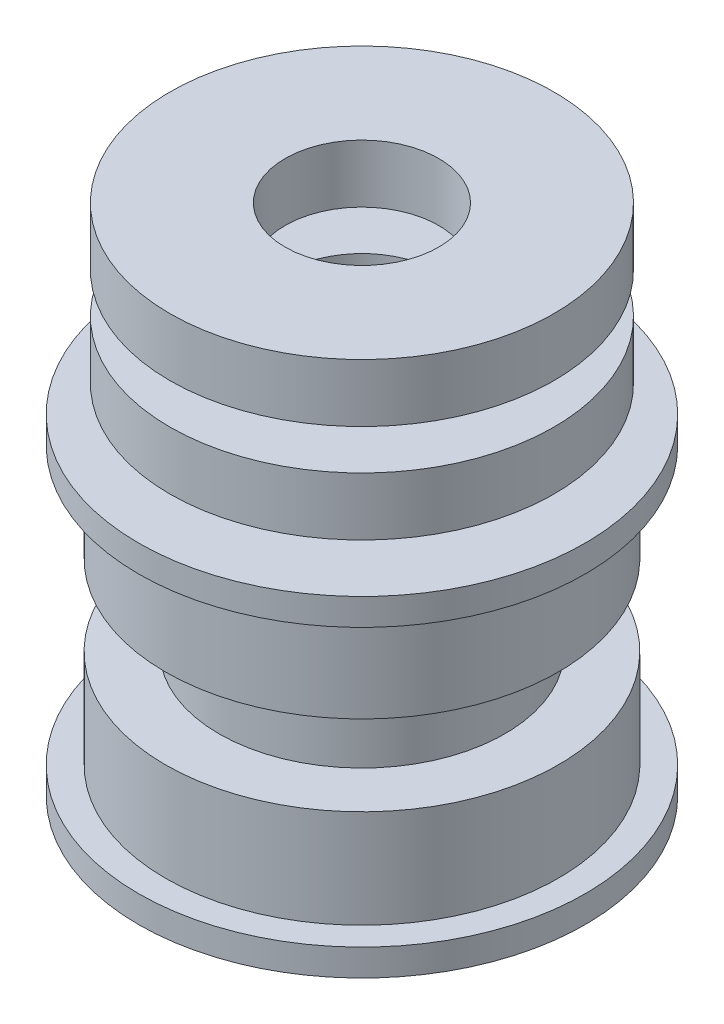
ISO-10303-21;
HEADER;
FILE_DESCRIPTION(('STEP AP214'),'2;1');
FILE_NAME('part.step','',(''),(''),'','','');
FILE_SCHEMA(('AUTOMOTIVE_DESIGN { 1 0 10303 214 1 1 1 1 }'));
ENDSEC;
DATA;
#1=APPLICATION_CONTEXT('core data for automotive mechanical design processes');
#2=APPLICATION_PROTOCOL_DEFINITION('international standard','automotive_design',2000,#1);
#3=PRODUCT_CONTEXT('',#1,'mechanical');
#4=PRODUCT('Part','Part','',(#3));
#5=PRODUCT_RELATED_PRODUCT_CATEGORY('part','',(#4));
#6=PRODUCT_DEFINITION_FORMATION('','',#4);
#7=PRODUCT_DEFINITION_CONTEXT('part definition',#1,'design');
#8=PRODUCT_DEFINITION('design','',#6,#7);
#9=PRODUCT_DEFINITION_SHAPE('','',#8);
#10=(LENGTH_UNIT() NAMED_UNIT(*) SI_UNIT(.MILLI.,.METRE.));
#11=(NAMED_UNIT(*) PLANE_ANGLE_UNIT() SI_UNIT($,.RADIAN.));
#12=(NAMED_UNIT(*) SI_UNIT($,.STERADIAN.) SOLID_ANGLE_UNIT());
#13=UNCERTAINTY_MEASURE_WITH_UNIT(LENGTH_MEASURE(1.E-05),#10,'distance_accuracy_value','');
#14=(GEOMETRIC_REPRESENTATION_CONTEXT(3) GLOBAL_UNCERTAINTY_ASSIGNED_CONTEXT((#13)) GLOBAL_UNIT_ASSIGNED_CONTEXT((#10,
#11,#12)) REPRESENTATION_CONTEXT('',''));
#15=CARTESIAN_POINT('',(0.,0.,0.));
#16=DIRECTION('',(0.,0.,1.));
#17=DIRECTION('',(1.,0.,0.));
#18=AXIS2_PLACEMENT_3D('',#15,#16,#17);
#19=CARTESIAN_POINT('',(0.,28.75,0.));
#20=DIRECTION('',(0.,-1.,0.));
#21=DIRECTION('',(0.,0.,-1.));
#22=AXIS2_PLACEMENT_3D('',#19,#20,#21);
#23=CYLINDRICAL_SURFACE('',#22,10.75);
#24=CARTESIAN_POINT('',(0.,28.75,0.));
#25=DIRECTION('',(0.,1.,0.));
#26=DIRECTION('',(0.,0.,1.));
#27=AXIS2_PLACEMENT_3D('',#24,#25,#26);
#28=CIRCLE('',#27,10.75);
#29=CARTESIAN_POINT('',(0.,28.75,10.75));
#30=VERTEX_POINT('',#29);
#31=EDGE_CURVE('E11',#30,#30,#28,.T.);
#32=ORIENTED_EDGE('',*,*,#31,.F.);
#33=EDGE_LOOP('',(#32));
#34=FACE_BOUND('',#33,.T.);
#35=CARTESIAN_POINT('',(0.,25.5,0.));
#36=DIRECTION('',(0.,1.,0.));
#37=DIRECTION('',(0.,0.,1.));
#38=AXIS2_PLACEMENT_3D('',#35,#36,#37);
#39=CIRCLE('',#38,10.75);
#40=CARTESIAN_POINT('',(0.,25.5,10.75));
#41=VERTEX_POINT('',#40);
#42=EDGE_CURVE('E55',#41,#41,#39,.T.);
#43=ORIENTED_EDGE('',*,*,#42,.T.);
#44=EDGE_LOOP('',(#43));
#45=FACE_BOUND('',#44,.T.);
#46=ADVANCED_FACE('F48',(#34,#45),#23,.T.);
#47=CARTESIAN_POINT('',(0.,28.75,0.));
#48=DIRECTION('',(0.,1.,0.));
#49=DIRECTION('',(0.,0.,1.));
#50=AXIS2_PLACEMENT_3D('',#47,#48,#49);
#51=PLANE('',#50);
#52=CARTESIAN_POINT('',(0.,28.75,0.));
#53=DIRECTION('',(0.,1.,0.));
#54=DIRECTION('',(0.,0.,1.));
#55=AXIS2_PLACEMENT_3D('',#52,#53,#54);
#56=CIRCLE('',#55,4.3);
#57=CARTESIAN_POINT('',(0.,28.75,4.3));
#58=VERTEX_POINT('',#57);
#59=EDGE_CURVE('E60',#58,#58,#56,.T.);
#60=ORIENTED_EDGE('',*,*,#59,.F.);
#61=EDGE_LOOP('',(#60));
#62=FACE_BOUND('',#61,.T.);
#63=ORIENTED_EDGE('',*,*,#31,.T.);
#64=EDGE_LOOP('',(#63));
#65=FACE_BOUND('',#64,.T.);
#66=ADVANCED_FACE('F77',(#62,#65),#51,.T.);
#67=CARTESIAN_POINT('',(0.,25.5,0.));
#68=DIRECTION('',(0.,1.,0.));
#69=DIRECTION('',(0.,0.,1.));
#70=AXIS2_PLACEMENT_3D('',#67,#68,#69);
#71=PLANE('',#70);
#72=CARTESIAN_POINT('',(0.,25.5,0.));
#73=DIRECTION('',(0.,1.,0.));
#74=DIRECTION('',(0.,0.,1.));
#75=AXIS2_PLACEMENT_3D('',#72,#73,#74);
#76=CIRCLE('',#75,4.3);
#77=CARTESIAN_POINT('',(0.,25.5,4.3));
#78=VERTEX_POINT('',#77);
#79=EDGE_CURVE('E51',#78,#78,#76,.T.);
#80=ORIENTED_EDGE('',*,*,#79,.T.);
#81=EDGE_LOOP('',(#80));
#82=FACE_BOUND('',#81,.T.);
#83=ORIENTED_EDGE('',*,*,#42,.F.);
#84=EDGE_LOOP('',(#83));
#85=FACE_BOUND('',#84,.T.);
#86=ADVANCED_FACE('F68',(#82,#85),#71,.F.);
#87=CARTESIAN_POINT('',(0.,50.,0.));
#88=DIRECTION('',(0.,-1.,0.));
#89=DIRECTION('',(0.,0.,-1.));
#90=AXIS2_PLACEMENT_3D('',#87,#88,#89);
#91=CYLINDRICAL_SURFACE('',#90,4.3);
#92=ORIENTED_EDGE('',*,*,#59,.T.);
#93=EDGE_LOOP('',(#92));
#94=FACE_BOUND('',#93,.T.);
#95=ORIENTED_EDGE('',*,*,#79,.F.);
#96=EDGE_LOOP('',(#95));
#97=FACE_BOUND('',#96,.T.);
#98=ADVANCED_FACE('F71',(#94,#97),#91,.F.);
#99=CLOSED_SHELL('',(#46,#66,#86,#98));
#100=MANIFOLD_SOLID_BREP('B2',#99);
#101=CARTESIAN_POINT('',(0.,1.5,0.));
#102=DIRECTION('',(0.,-1.,0.));
#103=DIRECTION('',(0.,0.,-1.));
#104=AXIS2_PLACEMENT_3D('',#101,#102,#103);
#105=CYLINDRICAL_SURFACE('',#104,12.5);
#106=CARTESIAN_POINT('',(0.,1.5,0.));
#107=DIRECTION('',(0.,1.,0.));
#108=DIRECTION('',(0.,0.,1.));
#109=AXIS2_PLACEMENT_3D('',#106,#107,#108);
#110=CIRCLE('',#109,12.5);
#111=CARTESIAN_POINT('',(0.,1.5,12.5));
#112=VERTEX_POINT('',#111);
#113=EDGE_CURVE('E156',#112,#112,#110,.T.);
#114=ORIENTED_EDGE('',*,*,#113,.F.);
#115=EDGE_LOOP('',(#114));
#116=FACE_BOUND('',#115,.T.);
#117=CARTESIAN_POINT('',(0.,0.,0.));
#118=DIRECTION('',(0.,1.,0.));
#119=DIRECTION('',(0.,0.,1.));
#120=AXIS2_PLACEMENT_3D('',#117,#118,#119);
#121=CIRCLE('',#120,12.5);
#122=CARTESIAN_POINT('',(0.,0.,12.5));
#123=VERTEX_POINT('',#122);
#124=EDGE_CURVE('E153',#123,#123,#121,.T.);
#125=ORIENTED_EDGE('',*,*,#124,.T.);
#126=EDGE_LOOP('',(#125));
#127=FACE_BOUND('',#126,.T.);
#128=ADVANCED_FACE('F117',(#116,#127),#105,.T.);
#129=CARTESIAN_POINT('',(0.,1.5,0.));
#130=DIRECTION('',(0.,1.,0.));
#131=DIRECTION('',(0.,0.,1.));
#132=AXIS2_PLACEMENT_3D('',#129,#130,#131);
#133=PLANE('',#132);
#134=CARTESIAN_POINT('',(0.,1.5,0.));
#135=DIRECTION('',(0.,1.,0.));
#136=DIRECTION('',(0.,0.,1.));
#137=AXIS2_PLACEMENT_3D('',#134,#135,#136);
#138=CIRCLE('',#137,11.);
#139=CARTESIAN_POINT('',(0.,1.5,11.));
#140=VERTEX_POINT('',#139);
#141=EDGE_CURVE('E129',#140,#140,#138,.T.);
#142=ORIENTED_EDGE('',*,*,#141,.F.);
#143=EDGE_LOOP('',(#142));
#144=FACE_BOUND('',#143,.T.);
#145=ORIENTED_EDGE('',*,*,#113,.T.);
#146=EDGE_LOOP('',(#145));
#147=FACE_BOUND('',#146,.T.);
#148=ADVANCED_FACE('F165',(#144,#147),#133,.T.);
#149=CARTESIAN_POINT('',(0.,0.,0.));
#150=DIRECTION('',(0.,1.,0.));
#151=DIRECTION('',(0.,0.,1.));
#152=AXIS2_PLACEMENT_3D('',#149,#150,#151);
#153=PLANE('',#152);
#154=CARTESIAN_POINT('',(0.,0.,0.));
#155=DIRECTION('',(0.,-1.,0.));
#156=DIRECTION('',(0.,0.,-1.));
#157=AXIS2_PLACEMENT_3D('',#154,#155,#156);
#158=CIRCLE('',#157,4.3);
#159=CARTESIAN_POINT('',(0.,0.,-4.3));
#160=VERTEX_POINT('',#159);
#161=EDGE_CURVE('E384',#160,#160,#158,.T.);
#162=ORIENTED_EDGE('',*,*,#161,.F.);
#163=EDGE_LOOP('',(#162));
#164=FACE_BOUND('',#163,.T.);
#165=ORIENTED_EDGE('',*,*,#124,.F.);
#166=EDGE_LOOP('',(#165));
#167=FACE_BOUND('',#166,.T.);
#168=ADVANCED_FACE('F162',(#164,#167),#153,.F.);
#169=CARTESIAN_POINT('',(0.,7.,0.));
#170=DIRECTION('',(0.,-1.,0.));
#171=DIRECTION('',(0.,0.,-1.));
#172=AXIS2_PLACEMENT_3D('',#169,#170,#171);
#173=CYLINDRICAL_SURFACE('',#172,11.);
#174=CARTESIAN_POINT('',(0.,7.,0.));
#175=DIRECTION('',(0.,1.,0.));
#176=DIRECTION('',(0.,0.,1.));
#177=AXIS2_PLACEMENT_3D('',#174,#175,#176);
#178=CIRCLE('',#177,11.);
#179=CARTESIAN_POINT('',(0.,7.,11.));
#180=VERTEX_POINT('',#179);
#181=EDGE_CURVE('E138',#180,#180,#178,.T.);
#182=ORIENTED_EDGE('',*,*,#181,.F.);
#183=EDGE_LOOP('',(#182));
#184=FACE_BOUND('',#183,.T.);
#185=ORIENTED_EDGE('',*,*,#141,.T.);
#186=EDGE_LOOP('',(#185));
#187=FACE_BOUND('',#186,.T.);
#188=ADVANCED_FACE('F164',(#184,#187),#173,.T.);
#189=CARTESIAN_POINT('',(0.,7.,0.));
#190=DIRECTION('',(0.,1.,0.));
#191=DIRECTION('',(0.,0.,1.));
#192=AXIS2_PLACEMENT_3D('',#189,#190,#191);
#193=PLANE('',#192);
#194=CARTESIAN_POINT('',(0.,7.,0.));
#195=DIRECTION('',(0.,1.,0.));
#196=DIRECTION('',(0.,0.,1.));
#197=AXIS2_PLACEMENT_3D('',#194,#195,#196);
#198=CIRCLE('',#197,8.);
#199=CARTESIAN_POINT('',(0.,7.,8.));
#200=VERTEX_POINT('',#199);
#201=EDGE_CURVE('E124',#200,#200,#198,.T.);
#202=ORIENTED_EDGE('',*,*,#201,.F.);
#203=EDGE_LOOP('',(#202));
#204=FACE_BOUND('',#203,.T.);
#205=ORIENTED_EDGE('',*,*,#181,.T.);
#206=EDGE_LOOP('',(#205));
#207=FACE_BOUND('',#206,.T.);
#208=ADVANCED_FACE('F171',(#204,#207),#193,.T.);
#209=CARTESIAN_POINT('',(0.,9.25,0.));
#210=DIRECTION('',(0.,-1.,0.));
#211=DIRECTION('',(0.,0.,-1.));
#212=AXIS2_PLACEMENT_3D('',#209,#210,#211);
#213=CYLINDRICAL_SURFACE('',#212,8.);
#214=ORIENTED_EDGE('',*,*,#201,.T.);
#215=EDGE_LOOP('',(#214));
#216=FACE_BOUND('',#215,.T.);
#217=CARTESIAN_POINT('',(0.,11.5,0.));
#218=DIRECTION('',(0.,1.,0.));
#219=DIRECTION('',(0.,0.,1.));
#220=AXIS2_PLACEMENT_3D('',#217,#218,#219);
#221=CIRCLE('',#220,8.);
#222=CARTESIAN_POINT('',(0.,11.5,8.));
#223=VERTEX_POINT('',#222);
#224=EDGE_CURVE('E135',#223,#223,#221,.T.);
#225=ORIENTED_EDGE('',*,*,#224,.F.);
#226=EDGE_LOOP('',(#225));
#227=FACE_BOUND('',#226,.T.);
#228=ADVANCED_FACE('F269',(#216,#227),#213,.T.);
#229=CARTESIAN_POINT('',(0.,17.,0.));
#230=DIRECTION('',(0.,1.,0.));
#231=DIRECTION('',(0.,0.,-1.));
#232=AXIS2_PLACEMENT_3D('',#229,#230,#231);
#233=CYLINDRICAL_SURFACE('',#232,12.5);
#234=CARTESIAN_POINT('',(0.,17.,0.));
#235=DIRECTION('',(0.,1.,0.));
#236=DIRECTION('',(0.,0.,1.));
#237=AXIS2_PLACEMENT_3D('',#234,#235,#236);
#238=CIRCLE('',#237,12.5);
#239=CARTESIAN_POINT('',(0.,17.,12.5));
#240=VERTEX_POINT('',#239);
#241=EDGE_CURVE('E146',#240,#240,#238,.T.);
#242=ORIENTED_EDGE('',*,*,#241,.T.);
#243=EDGE_LOOP('',(#242));
#244=FACE_BOUND('',#243,.T.);
#245=CARTESIAN_POINT('',(0.,18.5,0.));
#246=DIRECTION('',(0.,1.,0.));
#247=DIRECTION('',(0.,0.,1.));
#248=AXIS2_PLACEMENT_3D('',#245,#246,#247);
#249=CIRCLE('',#248,12.5);
#250=CARTESIAN_POINT('',(0.,18.5,12.5));
#251=VERTEX_POINT('',#250);
#252=EDGE_CURVE('E143',#251,#251,#249,.T.);
#253=ORIENTED_EDGE('',*,*,#252,.F.);
#254=EDGE_LOOP('',(#253));
#255=FACE_BOUND('',#254,.T.);
#256=ADVANCED_FACE('F262',(#244,#255),#233,.T.);
#257=CARTESIAN_POINT('',(0.,17.,0.));
#258=DIRECTION('',(0.,-1.,0.));
#259=DIRECTION('',(0.,0.,1.));
#260=AXIS2_PLACEMENT_3D('',#257,#258,#259);
#261=PLANE('',#260);
#262=CARTESIAN_POINT('',(0.,17.,0.));
#263=DIRECTION('',(0.,1.,0.));
#264=DIRECTION('',(0.,0.,1.));
#265=AXIS2_PLACEMENT_3D('',#262,#263,#264);
#266=CIRCLE('',#265,11.);
#267=CARTESIAN_POINT('',(0.,17.,11.));
#268=VERTEX_POINT('',#267);
#269=EDGE_CURVE('E139',#268,#268,#266,.T.);
#270=ORIENTED_EDGE('',*,*,#269,.T.);
#271=EDGE_LOOP('',(#270));
#272=FACE_BOUND('',#271,.T.);
#273=ORIENTED_EDGE('',*,*,#241,.F.);
#274=EDGE_LOOP('',(#273));
#275=FACE_BOUND('',#274,.T.);
#276=ADVANCED_FACE('F259',(#272,#275),#261,.T.);
#277=CARTESIAN_POINT('',(0.,18.5,0.));
#278=DIRECTION('',(0.,-1.,0.));
#279=DIRECTION('',(0.,0.,1.));
#280=AXIS2_PLACEMENT_3D('',#277,#278,#279);
#281=PLANE('',#280);
#282=CARTESIAN_POINT('',(0.,18.5,0.));
#283=DIRECTION('',(0.,1.,0.));
#284=DIRECTION('',(0.,0.,1.));
#285=AXIS2_PLACEMENT_3D('',#282,#283,#284);
#286=CIRCLE('',#285,7.75);
#287=CARTESIAN_POINT('',(0.,18.5,7.75));
#288=VERTEX_POINT('',#287);
#289=EDGE_CURVE('E47',#288,#288,#286,.T.);
#290=ORIENTED_EDGE('',*,*,#289,.F.);
#291=EDGE_LOOP('',(#290));
#292=FACE_BOUND('',#291,.T.);
#293=ORIENTED_EDGE('',*,*,#252,.T.);
#294=EDGE_LOOP('',(#293));
#295=FACE_BOUND('',#294,.T.);
#296=ADVANCED_FACE('F257',(#292,#295),#281,.F.);
#297=CARTESIAN_POINT('',(0.,11.5,0.));
#298=DIRECTION('',(0.,1.,0.));
#299=DIRECTION('',(0.,0.,-1.));
#300=AXIS2_PLACEMENT_3D('',#297,#298,#299);
#301=CYLINDRICAL_SURFACE('',#300,11.);
#302=CARTESIAN_POINT('',(0.,11.5,0.));
#303=DIRECTION('',(0.,1.,0.));
#304=DIRECTION('',(0.,0.,1.));
#305=AXIS2_PLACEMENT_3D('',#302,#303,#304);
#306=CIRCLE('',#305,11.);
#307=CARTESIAN_POINT('',(0.,11.5,11.));
#308=VERTEX_POINT('',#307);
#309=EDGE_CURVE('E140',#308,#308,#306,.T.);
#310=ORIENTED_EDGE('',*,*,#309,.T.);
#311=EDGE_LOOP('',(#310));
#312=FACE_BOUND('',#311,.T.);
#313=ORIENTED_EDGE('',*,*,#269,.F.);
#314=EDGE_LOOP('',(#313));
#315=FACE_BOUND('',#314,.T.);
#316=ADVANCED_FACE('F253',(#312,#315),#301,.T.);
#317=CARTESIAN_POINT('',(0.,11.5,0.));
#318=DIRECTION('',(0.,-1.,0.));
#319=DIRECTION('',(0.,0.,1.));
#320=AXIS2_PLACEMENT_3D('',#317,#318,#319);
#321=PLANE('',#320);
#322=ORIENTED_EDGE('',*,*,#224,.T.);
#323=EDGE_LOOP('',(#322));
#324=FACE_BOUND('',#323,.T.);
#325=ORIENTED_EDGE('',*,*,#309,.F.);
#326=EDGE_LOOP('',(#325));
#327=FACE_BOUND('',#326,.T.);
#328=ADVANCED_FACE('F249',(#324,#327),#321,.T.);
#329=CARTESIAN_POINT('',(0.,20.,0.));
#330=DIRECTION('',(0.,-1.,0.));
#331=DIRECTION('',(0.,0.,-1.));
#332=AXIS2_PLACEMENT_3D('',#329,#330,#331);
#333=CYLINDRICAL_SURFACE('',#332,7.75);
#334=CARTESIAN_POINT('',(0.,20.,0.));
#335=DIRECTION('',(0.,1.,0.));
#336=DIRECTION('',(0.,0.,1.));
#337=AXIS2_PLACEMENT_3D('',#334,#335,#336);
#338=CIRCLE('',#337,7.75);
#339=CARTESIAN_POINT('',(0.,20.,7.75));
#340=VERTEX_POINT('',#339);
#341=EDGE_CURVE('E133',#340,#340,#338,.T.);
#342=ORIENTED_EDGE('',*,*,#341,.F.);
#343=EDGE_LOOP('',(#342));
#344=FACE_BOUND('',#343,.T.);
#345=ORIENTED_EDGE('',*,*,#289,.T.);
#346=EDGE_LOOP('',(#345));
#347=FACE_BOUND('',#346,.T.);
#348=ADVANCED_FACE('F245',(#344,#347),#333,.T.);
#349=CARTESIAN_POINT('',(0.,23.25,0.));
#350=DIRECTION('',(0.,-1.,0.));
#351=DIRECTION('',(0.,0.,-1.));
#352=AXIS2_PLACEMENT_3D('',#349,#350,#351);
#353=CYLINDRICAL_SURFACE('',#352,10.75);
#354=CARTESIAN_POINT('',(0.,23.25,0.));
#355=DIRECTION('',(0.,1.,0.));
#356=DIRECTION('',(0.,0.,1.));
#357=AXIS2_PLACEMENT_3D('',#354,#355,#356);
#358=CIRCLE('',#357,10.75);
#359=CARTESIAN_POINT('',(0.,23.25,10.75));
#360=VERTEX_POINT('',#359);
#361=EDGE_CURVE('E376',#360,#360,#358,.T.);
#362=ORIENTED_EDGE('',*,*,#361,.F.);
#363=EDGE_LOOP('',(#362));
#364=FACE_BOUND('',#363,.T.);
#365=CARTESIAN_POINT('',(0.,20.,0.));
#366=DIRECTION('',(0.,1.,0.));
#367=DIRECTION('',(0.,0.,1.));
#368=AXIS2_PLACEMENT_3D('',#365,#366,#367);
#369=CIRCLE('',#368,10.75);
#370=CARTESIAN_POINT('',(0.,20.,10.75));
#371=VERTEX_POINT('',#370);
#372=EDGE_CURVE('E378',#371,#371,#369,.T.);
#373=ORIENTED_EDGE('',*,*,#372,.T.);
#374=EDGE_LOOP('',(#373));
#375=FACE_BOUND('',#374,.T.);
#376=ADVANCED_FACE('F219',(#364,#375),#353,.T.);
#377=CARTESIAN_POINT('',(0.,23.25,0.));
#378=DIRECTION('',(0.,1.,0.));
#379=DIRECTION('',(0.,0.,1.));
#380=AXIS2_PLACEMENT_3D('',#377,#378,#379);
#381=PLANE('',#380);
#382=CARTESIAN_POINT('',(0.,23.25,0.));
#383=DIRECTION('',(0.,1.,0.));
#384=DIRECTION('',(0.,0.,1.));
#385=AXIS2_PLACEMENT_3D('',#382,#383,#384);
#386=CIRCLE('',#385,4.3);
#387=CARTESIAN_POINT('',(0.,23.25,4.3));
#388=VERTEX_POINT('',#387);
#389=EDGE_CURVE('E120',#388,#388,#386,.T.);
#390=ORIENTED_EDGE('',*,*,#389,.F.);
#391=EDGE_LOOP('',(#390));
#392=FACE_BOUND('',#391,.T.);
#393=ORIENTED_EDGE('',*,*,#361,.T.);
#394=EDGE_LOOP('',(#393));
#395=FACE_BOUND('',#394,.T.);
#396=ADVANCED_FACE('F214',(#392,#395),#381,.T.);
#397=CARTESIAN_POINT('',(0.,20.,0.));
#398=DIRECTION('',(0.,1.,0.));
#399=DIRECTION('',(0.,0.,1.));
#400=AXIS2_PLACEMENT_3D('',#397,#398,#399);
#401=PLANE('',#400);
#402=ORIENTED_EDGE('',*,*,#341,.T.);
#403=EDGE_LOOP('',(#402));
#404=FACE_BOUND('',#403,.T.);
#405=ORIENTED_EDGE('',*,*,#372,.F.);
#406=EDGE_LOOP('',(#405));
#407=FACE_BOUND('',#406,.T.);
#408=ADVANCED_FACE('F209',(#404,#407),#401,.F.);
#409=CARTESIAN_POINT('',(0.,50.,0.));
#410=DIRECTION('',(0.,-1.,0.));
#411=DIRECTION('',(0.,0.,-1.));
#412=AXIS2_PLACEMENT_3D('',#409,#410,#411);
#413=CYLINDRICAL_SURFACE('',#412,4.3);
#414=ORIENTED_EDGE('',*,*,#389,.T.);
#415=EDGE_LOOP('',(#414));
#416=FACE_BOUND('',#415,.T.);
#417=ORIENTED_EDGE('',*,*,#161,.T.);
#418=EDGE_LOOP('',(#417));
#419=FACE_BOUND('',#418,.T.);
#420=ADVANCED_FACE('F228',(#416,#419),#413,.F.);
#421=CLOSED_SHELL('',(#128,#148,#168,#188,#208,#228,#256,#276,#296,#316,#328,#348,#376,#396,
#408,#420));
#422=MANIFOLD_SOLID_BREP('B6',#421);
#423=ADVANCED_BREP_SHAPE_REPRESENTATION('',(#18,#100,#422),#14);
#424=SHAPE_DEFINITION_REPRESENTATION(#9,#423);
ENDSEC;
END-ISO-10303-21;
